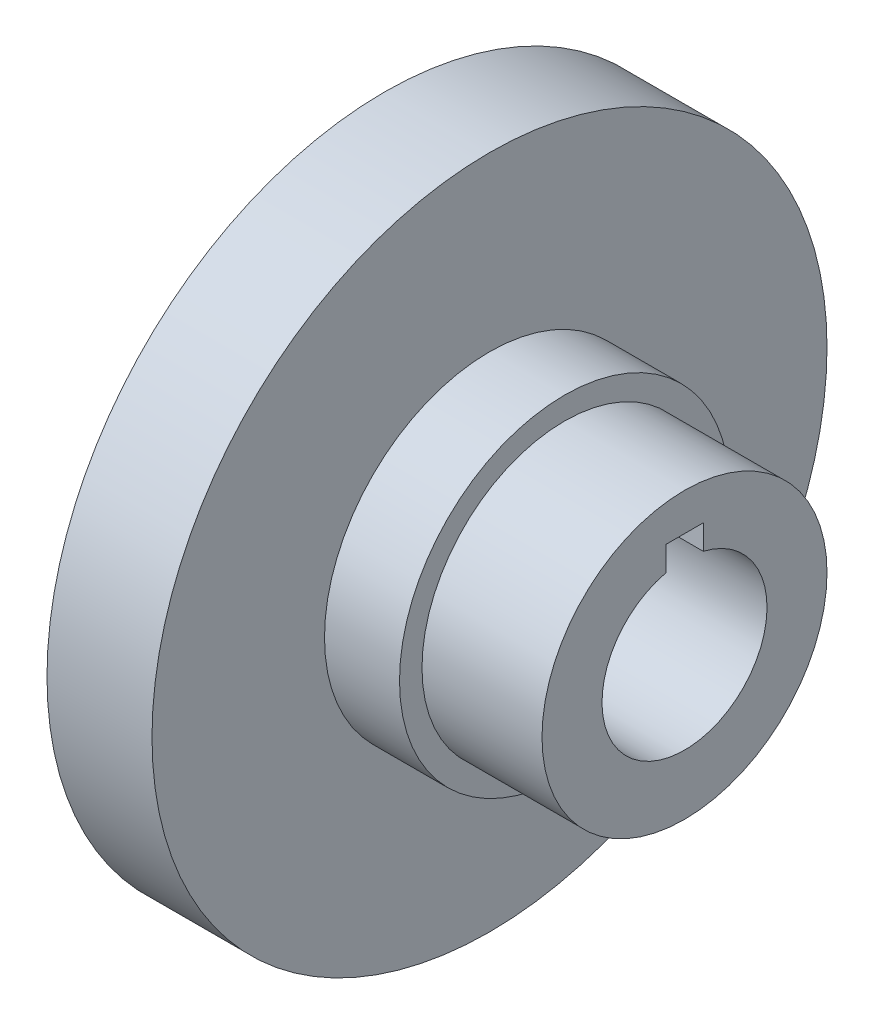
ISO-10303-21;
HEADER;
FILE_DESCRIPTION(('STEP AP214'),'2;1');
FILE_NAME('part.step','',(''),(''),'','','');
FILE_SCHEMA(('AUTOMOTIVE_DESIGN { 1 0 10303 214 1 1 1 1 }'));
ENDSEC;
DATA;
#1=APPLICATION_CONTEXT('core data for automotive mechanical design processes');
#2=APPLICATION_PROTOCOL_DEFINITION('international standard','automotive_design',2000,#1);
#3=PRODUCT_CONTEXT('',#1,'mechanical');
#4=PRODUCT('Part','Part','',(#3));
#5=PRODUCT_RELATED_PRODUCT_CATEGORY('part','',(#4));
#6=PRODUCT_DEFINITION_FORMATION('','',#4);
#7=PRODUCT_DEFINITION_CONTEXT('part definition',#1,'design');
#8=PRODUCT_DEFINITION('design','',#6,#7);
#9=PRODUCT_DEFINITION_SHAPE('','',#8);
#10=(LENGTH_UNIT() NAMED_UNIT(*) SI_UNIT(.MILLI.,.METRE.));
#11=(NAMED_UNIT(*) PLANE_ANGLE_UNIT() SI_UNIT($,.RADIAN.));
#12=(NAMED_UNIT(*) SI_UNIT($,.STERADIAN.) SOLID_ANGLE_UNIT());
#13=UNCERTAINTY_MEASURE_WITH_UNIT(LENGTH_MEASURE(1.E-05),#10,'distance_accuracy_value','');
#14=(GEOMETRIC_REPRESENTATION_CONTEXT(3) GLOBAL_UNCERTAINTY_ASSIGNED_CONTEXT((#13)) GLOBAL_UNIT_ASSIGNED_CONTEXT((#10,
#11,#12)) REPRESENTATION_CONTEXT('',''));
#15=CARTESIAN_POINT('',(0.,0.,0.));
#16=DIRECTION('',(0.,0.,1.));
#17=DIRECTION('',(1.,0.,0.));
#18=AXIS2_PLACEMENT_3D('',#15,#16,#17);
#19=CARTESIAN_POINT('',(24.,0.,0.));
#20=DIRECTION('',(1.,0.,0.));
#21=DIRECTION('',(0.,0.,-1.));
#22=AXIS2_PLACEMENT_3D('',#19,#20,#21);
#23=PLANE('',#22);
#24=CARTESIAN_POINT('',(24.,0.,0.));
#25=DIRECTION('',(1.,0.,0.));
#26=DIRECTION('',(0.,0.,-1.));
#27=AXIS2_PLACEMENT_3D('',#24,#25,#26);
#28=CIRCLE('',#27,22.);
#29=CARTESIAN_POINT('',(24.,0.,-22.));
#30=VERTEX_POINT('',#29);
#31=EDGE_CURVE('E112',#30,#30,#28,.T.);
#32=ORIENTED_EDGE('',*,*,#31,.T.);
#33=EDGE_LOOP('',(#32));
#34=FACE_BOUND('',#33,.T.);
#35=CARTESIAN_POINT('',(24.,0.,0.));
#36=DIRECTION('',(1.,0.,0.));
#37=DIRECTION('',(0.,0.,-1.));
#38=AXIS2_PLACEMENT_3D('',#35,#36,#37);
#39=CIRCLE('',#38,19.);
#40=CARTESIAN_POINT('',(24.,0.,-19.));
#41=VERTEX_POINT('',#40);
#42=EDGE_CURVE('E105',#41,#41,#39,.T.);
#43=ORIENTED_EDGE('',*,*,#42,.F.);
#44=EDGE_LOOP('',(#43));
#45=FACE_BOUND('',#44,.T.);
#46=ADVANCED_FACE('F31',(#34,#45),#23,.T.);
#47=CARTESIAN_POINT('',(14.,0.,0.));
#48=DIRECTION('',(1.,0.,0.));
#49=DIRECTION('',(0.,0.,-1.));
#50=AXIS2_PLACEMENT_3D('',#47,#48,#49);
#51=PLANE('',#50);
#52=CARTESIAN_POINT('',(14.,0.,0.));
#53=DIRECTION('',(1.,0.,0.));
#54=DIRECTION('',(0.,0.,-1.));
#55=AXIS2_PLACEMENT_3D('',#52,#53,#54);
#56=CIRCLE('',#55,45.);
#57=CARTESIAN_POINT('',(14.,0.,-45.));
#58=VERTEX_POINT('',#57);
#59=EDGE_CURVE('E118',#58,#58,#56,.T.);
#60=ORIENTED_EDGE('',*,*,#59,.T.);
#61=EDGE_LOOP('',(#60));
#62=FACE_BOUND('',#61,.T.);
#63=CARTESIAN_POINT('',(14.,0.,0.));
#64=DIRECTION('',(1.,0.,0.));
#65=DIRECTION('',(0.,0.,-1.));
#66=AXIS2_PLACEMENT_3D('',#63,#64,#65);
#67=CIRCLE('',#66,22.);
#68=CARTESIAN_POINT('',(14.,0.,-22.));
#69=VERTEX_POINT('',#68);
#70=EDGE_CURVE('E109',#69,#69,#67,.T.);
#71=ORIENTED_EDGE('',*,*,#70,.F.);
#72=EDGE_LOOP('',(#71));
#73=FACE_BOUND('',#72,.T.);
#74=ADVANCED_FACE('F142',(#62,#73),#51,.T.);
#75=CARTESIAN_POINT('',(14.,0.,0.));
#76=DIRECTION('',(-1.,0.,0.));
#77=DIRECTION('',(0.,0.,1.));
#78=AXIS2_PLACEMENT_3D('',#75,#76,#77);
#79=CYLINDRICAL_SURFACE('',#78,45.);
#80=ORIENTED_EDGE('',*,*,#59,.F.);
#81=EDGE_LOOP('',(#80));
#82=FACE_BOUND('',#81,.T.);
#83=CARTESIAN_POINT('',(0.,0.,0.));
#84=DIRECTION('',(1.,0.,0.));
#85=DIRECTION('',(0.,0.,-1.));
#86=AXIS2_PLACEMENT_3D('',#83,#84,#85);
#87=CIRCLE('',#86,45.);
#88=CARTESIAN_POINT('',(0.,0.,-45.));
#89=VERTEX_POINT('',#88);
#90=EDGE_CURVE('E115',#89,#89,#87,.T.);
#91=ORIENTED_EDGE('',*,*,#90,.T.);
#92=EDGE_LOOP('',(#91));
#93=FACE_BOUND('',#92,.T.);
#94=ADVANCED_FACE('F148',(#82,#93),#79,.T.);
#95=CARTESIAN_POINT('',(0.,0.,0.));
#96=DIRECTION('',(1.,0.,0.));
#97=DIRECTION('',(0.,0.,-1.));
#98=AXIS2_PLACEMENT_3D('',#95,#96,#97);
#99=PLANE('',#98);
#100=CARTESIAN_POINT('',(0.,0.,-34.));
#101=DIRECTION('',(-1.,0.,0.));
#102=DIRECTION('',(0.,0.,1.));
#103=AXIS2_PLACEMENT_3D('',#100,#101,#102);
#104=CIRCLE('',#103,4.);
#105=CARTESIAN_POINT('',(0.,0.,-30.));
#106=VERTEX_POINT('',#105);
#107=EDGE_CURVE('E338',#106,#106,#104,.T.);
#108=ORIENTED_EDGE('',*,*,#107,.F.);
#109=EDGE_LOOP('',(#108));
#110=FACE_BOUND('',#109,.T.);
#111=CARTESIAN_POINT('',(0.,-34.,-3.56131302833157E-13));
#112=DIRECTION('',(-1.,0.,0.));
#113=DIRECTION('',(0.,0.,1.));
#114=AXIS2_PLACEMENT_3D('',#111,#112,#113);
#115=CIRCLE('',#114,4.);
#116=CARTESIAN_POINT('',(0.,-34.,3.99999999999964));
#117=VERTEX_POINT('',#116);
#118=EDGE_CURVE('E340',#117,#117,#115,.T.);
#119=ORIENTED_EDGE('',*,*,#118,.F.);
#120=EDGE_LOOP('',(#119));
#121=FACE_BOUND('',#120,.T.);
#122=CARTESIAN_POINT('',(0.,-2.37420868555438E-13,34.));
#123=DIRECTION('',(-1.,0.,0.));
#124=DIRECTION('',(0.,0.,1.));
#125=AXIS2_PLACEMENT_3D('',#122,#123,#124);
#126=CIRCLE('',#125,4.);
#127=CARTESIAN_POINT('',(0.,-2.37420868555438E-13,38.));
#128=VERTEX_POINT('',#127);
#129=EDGE_CURVE('E346',#128,#128,#126,.T.);
#130=ORIENTED_EDGE('',*,*,#129,.F.);
#131=EDGE_LOOP('',(#130));
#132=FACE_BOUND('',#131,.T.);
#133=CARTESIAN_POINT('',(0.,34.,1.18710434277719E-13));
#134=DIRECTION('',(-1.,0.,0.));
#135=DIRECTION('',(0.,0.,1.));
#136=AXIS2_PLACEMENT_3D('',#133,#134,#135);
#137=CIRCLE('',#136,4.);
#138=CARTESIAN_POINT('',(0.,34.,4.00000000000012));
#139=VERTEX_POINT('',#138);
#140=EDGE_CURVE('E352',#139,#139,#137,.T.);
#141=ORIENTED_EDGE('',*,*,#140,.F.);
#142=EDGE_LOOP('',(#141));
#143=FACE_BOUND('',#142,.T.);
#144=CARTESIAN_POINT('',(0.,0.,0.));
#145=DIRECTION('',(-1.,0.,0.));
#146=DIRECTION('',(0.,0.,1.));
#147=AXIS2_PLACEMENT_3D('',#144,#145,#146);
#148=CIRCLE('',#147,23.);
#149=CARTESIAN_POINT('',(0.,0.,23.));
#150=VERTEX_POINT('',#149);
#151=EDGE_CURVE('E100',#150,#150,#148,.T.);
#152=ORIENTED_EDGE('',*,*,#151,.F.);
#153=EDGE_LOOP('',(#152));
#154=FACE_BOUND('',#153,.T.);
#155=ORIENTED_EDGE('',*,*,#90,.F.);
#156=EDGE_LOOP('',(#155));
#157=FACE_BOUND('',#156,.T.);
#158=ADVANCED_FACE('F158',(#110,#121,#132,#143,#154,#157),#99,.F.);
#159=CARTESIAN_POINT('',(24.,0.,0.));
#160=DIRECTION('',(-1.,0.,0.));
#161=DIRECTION('',(0.,0.,1.));
#162=AXIS2_PLACEMENT_3D('',#159,#160,#161);
#163=CYLINDRICAL_SURFACE('',#162,22.);
#164=ORIENTED_EDGE('',*,*,#31,.F.);
#165=EDGE_LOOP('',(#164));
#166=FACE_BOUND('',#165,.T.);
#167=ORIENTED_EDGE('',*,*,#70,.T.);
#168=EDGE_LOOP('',(#167));
#169=FACE_BOUND('',#168,.T.);
#170=ADVANCED_FACE('F156',(#166,#169),#163,.T.);
#171=CARTESIAN_POINT('',(40.,0.,0.));
#172=DIRECTION('',(-1.,0.,0.));
#173=DIRECTION('',(0.,0.,1.));
#174=AXIS2_PLACEMENT_3D('',#171,#172,#173);
#175=CYLINDRICAL_SURFACE('',#174,19.);
#176=CARTESIAN_POINT('',(40.,0.,0.));
#177=DIRECTION('',(1.,0.,0.));
#178=DIRECTION('',(0.,0.,-1.));
#179=AXIS2_PLACEMENT_3D('',#176,#177,#178);
#180=CIRCLE('',#179,19.);
#181=CARTESIAN_POINT('',(40.,0.,-19.));
#182=VERTEX_POINT('',#181);
#183=EDGE_CURVE('E106',#182,#182,#180,.T.);
#184=ORIENTED_EDGE('',*,*,#183,.F.);
#185=EDGE_LOOP('',(#184));
#186=FACE_BOUND('',#185,.T.);
#187=ORIENTED_EDGE('',*,*,#42,.T.);
#188=EDGE_LOOP('',(#187));
#189=FACE_BOUND('',#188,.T.);
#190=ADVANCED_FACE('F154',(#186,#189),#175,.T.);
#191=CARTESIAN_POINT('',(40.,0.,0.));
#192=DIRECTION('',(1.,0.,0.));
#193=DIRECTION('',(0.,0.,-1.));
#194=AXIS2_PLACEMENT_3D('',#191,#192,#193);
#195=PLANE('',#194);
#196=DIRECTION('',(0.,1.,0.));
#197=VECTOR('',#196,1.);
#198=CARTESIAN_POINT('',(40.,14.,-2.5));
#199=LINE('',#198,#197);
#200=CARTESIAN_POINT('',(40.,10.7121426428143,-2.5));
#201=VERTEX_POINT('',#200);
#202=CARTESIAN_POINT('',(40.,14.,-2.5));
#203=VERTEX_POINT('',#202);
#204=EDGE_CURVE('E72',#201,#203,#199,.T.);
#205=ORIENTED_EDGE('',*,*,#204,.F.);
#206=CARTESIAN_POINT('',(40.,0.,0.));
#207=DIRECTION('',(-1.,0.,0.));
#208=DIRECTION('',(0.,0.,1.));
#209=AXIS2_PLACEMENT_3D('',#206,#207,#208);
#210=CIRCLE('',#209,11.);
#211=CARTESIAN_POINT('',(40.,10.7121426428143,2.5));
#212=VERTEX_POINT('',#211);
#213=EDGE_CURVE('E98',#201,#212,#210,.T.);
#214=ORIENTED_EDGE('',*,*,#213,.T.);
#215=DIRECTION('',(0.,1.,0.));
#216=VECTOR('',#215,1.);
#217=CARTESIAN_POINT('',(40.,14.,2.5));
#218=LINE('',#217,#216);
#219=CARTESIAN_POINT('',(40.,14.,2.5));
#220=VERTEX_POINT('',#219);
#221=EDGE_CURVE('E46',#212,#220,#218,.T.);
#222=ORIENTED_EDGE('',*,*,#221,.T.);
#223=DIRECTION('',(0.,0.,1.));
#224=VECTOR('',#223,1.);
#225=CARTESIAN_POINT('',(40.,14.,-2.5));
#226=LINE('',#225,#224);
#227=EDGE_CURVE('E86',#203,#220,#226,.T.);
#228=ORIENTED_EDGE('',*,*,#227,.F.);
#229=EDGE_LOOP('',(#205,#214,#222,#228));
#230=FACE_BOUND('',#229,.T.);
#231=ORIENTED_EDGE('',*,*,#183,.T.);
#232=EDGE_LOOP('',(#231));
#233=FACE_BOUND('',#232,.T.);
#234=ADVANCED_FACE('F90',(#230,#233),#195,.T.);
#235=CARTESIAN_POINT('',(12.,0.,0.));
#236=DIRECTION('',(-1.,0.,0.));
#237=DIRECTION('',(0.,0.,1.));
#238=AXIS2_PLACEMENT_3D('',#235,#236,#237);
#239=CYLINDRICAL_SURFACE('',#238,23.);
#240=CARTESIAN_POINT('',(9.,0.,0.));
#241=DIRECTION('',(-1.,0.,0.));
#242=DIRECTION('',(0.,0.,1.));
#243=AXIS2_PLACEMENT_3D('',#240,#241,#242);
#244=CIRCLE('',#243,23.);
#245=CARTESIAN_POINT('',(9.,0.,23.));
#246=VERTEX_POINT('',#245);
#247=EDGE_CURVE('E11',#246,#246,#244,.F.);
#248=ORIENTED_EDGE('',*,*,#247,.T.);
#249=EDGE_LOOP('',(#248));
#250=FACE_BOUND('',#249,.T.);
#251=ORIENTED_EDGE('',*,*,#151,.T.);
#252=EDGE_LOOP('',(#251));
#253=FACE_BOUND('',#252,.T.);
#254=ADVANCED_FACE('F198',(#250,#253),#239,.F.);
#255=CARTESIAN_POINT('',(12.,0.,0.));
#256=DIRECTION('',(-1.,0.,0.));
#257=DIRECTION('',(0.,0.,1.));
#258=AXIS2_PLACEMENT_3D('',#255,#256,#257);
#259=PLANE('',#258);
#260=CARTESIAN_POINT('',(12.,0.,0.));
#261=DIRECTION('',(-1.,0.,0.));
#262=DIRECTION('',(0.,0.,1.));
#263=AXIS2_PLACEMENT_3D('',#260,#261,#262);
#264=CIRCLE('',#263,20.);
#265=CARTESIAN_POINT('',(12.,0.,20.));
#266=VERTEX_POINT('',#265);
#267=EDGE_CURVE('E39',#266,#266,#264,.T.);
#268=ORIENTED_EDGE('',*,*,#267,.T.);
#269=EDGE_LOOP('',(#268));
#270=FACE_BOUND('',#269,.T.);
#271=DIRECTION('',(0.,-1.,0.));
#272=VECTOR('',#271,1.);
#273=CARTESIAN_POINT('',(12.,0.,-2.5));
#274=LINE('',#273,#272);
#275=CARTESIAN_POINT('',(12.,14.,-2.5));
#276=VERTEX_POINT('',#275);
#277=CARTESIAN_POINT('',(12.,10.7121426428143,-2.5));
#278=VERTEX_POINT('',#277);
#279=EDGE_CURVE('E54',#276,#278,#274,.T.);
#280=ORIENTED_EDGE('',*,*,#279,.F.);
#281=DIRECTION('',(0.,0.,1.));
#282=VECTOR('',#281,1.);
#283=CARTESIAN_POINT('',(12.,14.,-2.5));
#284=LINE('',#283,#282);
#285=CARTESIAN_POINT('',(12.,14.,2.5));
#286=VERTEX_POINT('',#285);
#287=EDGE_CURVE('E88',#276,#286,#284,.T.);
#288=ORIENTED_EDGE('',*,*,#287,.T.);
#289=DIRECTION('',(0.,-1.,0.));
#290=VECTOR('',#289,1.);
#291=CARTESIAN_POINT('',(12.,0.,2.5));
#292=LINE('',#291,#290);
#293=CARTESIAN_POINT('',(12.,10.7121426428143,2.5));
#294=VERTEX_POINT('',#293);
#295=EDGE_CURVE('E81',#286,#294,#292,.T.);
#296=ORIENTED_EDGE('',*,*,#295,.T.);
#297=CARTESIAN_POINT('',(12.,0.,0.));
#298=DIRECTION('',(-1.,0.,0.));
#299=DIRECTION('',(0.,0.,1.));
#300=AXIS2_PLACEMENT_3D('',#297,#298,#299);
#301=CIRCLE('',#300,11.);
#302=EDGE_CURVE('E93',#278,#294,#301,.T.);
#303=ORIENTED_EDGE('',*,*,#302,.F.);
#304=EDGE_LOOP('',(#280,#288,#296,#303));
#305=FACE_BOUND('',#304,.T.);
#306=ADVANCED_FACE('F128',(#270,#305),#259,.T.);
#307=CARTESIAN_POINT('',(40.,0.,0.));
#308=DIRECTION('',(-1.,0.,0.));
#309=DIRECTION('',(0.,0.,1.));
#310=AXIS2_PLACEMENT_3D('',#307,#308,#309);
#311=CYLINDRICAL_SURFACE('',#310,11.);
#312=ORIENTED_EDGE('',*,*,#213,.F.);
#313=DIRECTION('',(-1.,0.,0.));
#314=VECTOR('',#313,1.);
#315=CARTESIAN_POINT('',(40.,10.7121426428143,-2.5));
#316=LINE('',#315,#314);
#317=EDGE_CURVE('E76',#201,#278,#316,.T.);
#318=ORIENTED_EDGE('',*,*,#317,.T.);
#319=ORIENTED_EDGE('',*,*,#302,.T.);
#320=DIRECTION('',(-1.,0.,0.));
#321=VECTOR('',#320,1.);
#322=CARTESIAN_POINT('',(40.,10.7121426428143,2.5));
#323=LINE('',#322,#321);
#324=EDGE_CURVE('E121',#212,#294,#323,.T.);
#325=ORIENTED_EDGE('',*,*,#324,.F.);
#326=EDGE_LOOP('',(#312,#318,#319,#325));
#327=FACE_BOUND('',#326,.T.);
#328=ADVANCED_FACE('F216',(#327),#311,.F.);
#329=CARTESIAN_POINT('',(40.,0.,-2.5));
#330=DIRECTION('',(0.,0.,-1.));
#331=DIRECTION('',(-1.,0.,0.));
#332=AXIS2_PLACEMENT_3D('',#329,#330,#331);
#333=PLANE('',#332);
#334=ORIENTED_EDGE('',*,*,#204,.T.);
#335=DIRECTION('',(-1.,0.,0.));
#336=VECTOR('',#335,1.);
#337=CARTESIAN_POINT('',(12.,14.,-2.5));
#338=LINE('',#337,#336);
#339=EDGE_CURVE('E75',#203,#276,#338,.T.);
#340=ORIENTED_EDGE('',*,*,#339,.T.);
#341=ORIENTED_EDGE('',*,*,#279,.T.);
#342=ORIENTED_EDGE('',*,*,#317,.F.);
#343=EDGE_LOOP('',(#334,#340,#341,#342));
#344=FACE_BOUND('',#343,.T.);
#345=ADVANCED_FACE('F74',(#344),#333,.F.);
#346=CARTESIAN_POINT('',(40.,0.,2.5));
#347=DIRECTION('',(0.,0.,-1.));
#348=DIRECTION('',(-1.,0.,0.));
#349=AXIS2_PLACEMENT_3D('',#346,#347,#348);
#350=PLANE('',#349);
#351=ORIENTED_EDGE('',*,*,#324,.T.);
#352=ORIENTED_EDGE('',*,*,#295,.F.);
#353=DIRECTION('',(-1.,0.,0.));
#354=VECTOR('',#353,1.);
#355=CARTESIAN_POINT('',(12.,14.,2.5));
#356=LINE('',#355,#354);
#357=EDGE_CURVE('E361',#220,#286,#356,.T.);
#358=ORIENTED_EDGE('',*,*,#357,.F.);
#359=ORIENTED_EDGE('',*,*,#221,.F.);
#360=EDGE_LOOP('',(#351,#352,#358,#359));
#361=FACE_BOUND('',#360,.T.);
#362=ADVANCED_FACE('F230',(#361),#350,.T.);
#363=CARTESIAN_POINT('',(12.,14.,-2.5));
#364=DIRECTION('',(0.,1.,0.));
#365=DIRECTION('',(0.,0.,1.));
#366=AXIS2_PLACEMENT_3D('',#363,#364,#365);
#367=PLANE('',#366);
#368=ORIENTED_EDGE('',*,*,#357,.T.);
#369=ORIENTED_EDGE('',*,*,#287,.F.);
#370=ORIENTED_EDGE('',*,*,#339,.F.);
#371=ORIENTED_EDGE('',*,*,#227,.T.);
#372=EDGE_LOOP('',(#368,#369,#370,#371));
#373=FACE_BOUND('',#372,.T.);
#374=ADVANCED_FACE('F85',(#373),#367,.F.);
#375=CARTESIAN_POINT('',(12.,34.,1.18710434277719E-13));
#376=DIRECTION('',(-1.,0.,0.));
#377=DIRECTION('',(0.,0.,1.));
#378=AXIS2_PLACEMENT_3D('',#375,#376,#377);
#379=CYLINDRICAL_SURFACE('',#378,4.);
#380=CARTESIAN_POINT('',(12.,34.,1.18710434277719E-13));
#381=DIRECTION('',(-1.,0.,0.));
#382=DIRECTION('',(0.,0.,1.));
#383=AXIS2_PLACEMENT_3D('',#380,#381,#382);
#384=CIRCLE('',#383,4.);
#385=CARTESIAN_POINT('',(12.,34.,4.00000000000012));
#386=VERTEX_POINT('',#385);
#387=EDGE_CURVE('E355',#386,#386,#384,.T.);
#388=ORIENTED_EDGE('',*,*,#387,.F.);
#389=EDGE_LOOP('',(#388));
#390=FACE_BOUND('',#389,.T.);
#391=ORIENTED_EDGE('',*,*,#140,.T.);
#392=EDGE_LOOP('',(#391));
#393=FACE_BOUND('',#392,.T.);
#394=ADVANCED_FACE('F242',(#390,#393),#379,.F.);
#395=CARTESIAN_POINT('',(12.,-99.1414213562373,0.));
#396=DIRECTION('',(-1.,0.,0.));
#397=DIRECTION('',(0.,0.,1.));
#398=AXIS2_PLACEMENT_3D('',#395,#396,#397);
#399=PLANE('',#398);
#400=ORIENTED_EDGE('',*,*,#387,.T.);
#401=EDGE_LOOP('',(#400));
#402=FACE_BOUND('',#401,.T.);
#403=ADVANCED_FACE('F248',(#402),#399,.T.);
#404=CARTESIAN_POINT('',(12.,-2.37420868555438E-13,34.));
#405=DIRECTION('',(-1.,0.,0.));
#406=DIRECTION('',(0.,0.,1.));
#407=AXIS2_PLACEMENT_3D('',#404,#405,#406);
#408=CYLINDRICAL_SURFACE('',#407,4.);
#409=CARTESIAN_POINT('',(12.,-2.37420868555438E-13,34.));
#410=DIRECTION('',(-1.,0.,0.));
#411=DIRECTION('',(0.,0.,1.));
#412=AXIS2_PLACEMENT_3D('',#409,#410,#411);
#413=CIRCLE('',#412,4.);
#414=CARTESIAN_POINT('',(12.,-2.37420868555438E-13,38.));
#415=VERTEX_POINT('',#414);
#416=EDGE_CURVE('E349',#415,#415,#413,.T.);
#417=ORIENTED_EDGE('',*,*,#416,.F.);
#418=EDGE_LOOP('',(#417));
#419=FACE_BOUND('',#418,.T.);
#420=ORIENTED_EDGE('',*,*,#129,.T.);
#421=EDGE_LOOP('',(#420));
#422=FACE_BOUND('',#421,.T.);
#423=ADVANCED_FACE('F256',(#419,#422),#408,.F.);
#424=CARTESIAN_POINT('',(12.,-99.1414213562373,0.));
#425=DIRECTION('',(-1.,0.,0.));
#426=DIRECTION('',(0.,0.,1.));
#427=AXIS2_PLACEMENT_3D('',#424,#425,#426);
#428=PLANE('',#427);
#429=ORIENTED_EDGE('',*,*,#416,.T.);
#430=EDGE_LOOP('',(#429));
#431=FACE_BOUND('',#430,.T.);
#432=ADVANCED_FACE('F264',(#431),#428,.T.);
#433=CARTESIAN_POINT('',(12.,-34.,-3.56131302833157E-13));
#434=DIRECTION('',(-1.,0.,0.));
#435=DIRECTION('',(0.,0.,1.));
#436=AXIS2_PLACEMENT_3D('',#433,#434,#435);
#437=CYLINDRICAL_SURFACE('',#436,4.);
#438=CARTESIAN_POINT('',(12.,-34.,-3.56131302833157E-13));
#439=DIRECTION('',(-1.,0.,0.));
#440=DIRECTION('',(0.,0.,1.));
#441=AXIS2_PLACEMENT_3D('',#438,#439,#440);
#442=CIRCLE('',#441,4.);
#443=CARTESIAN_POINT('',(12.,-34.,3.99999999999964));
#444=VERTEX_POINT('',#443);
#445=EDGE_CURVE('E343',#444,#444,#442,.T.);
#446=ORIENTED_EDGE('',*,*,#445,.F.);
#447=EDGE_LOOP('',(#446));
#448=FACE_BOUND('',#447,.T.);
#449=ORIENTED_EDGE('',*,*,#118,.T.);
#450=EDGE_LOOP('',(#449));
#451=FACE_BOUND('',#450,.T.);
#452=ADVANCED_FACE('F272',(#448,#451),#437,.F.);
#453=CARTESIAN_POINT('',(12.,-99.1414213562373,0.));
#454=DIRECTION('',(-1.,0.,0.));
#455=DIRECTION('',(0.,0.,1.));
#456=AXIS2_PLACEMENT_3D('',#453,#454,#455);
#457=PLANE('',#456);
#458=ORIENTED_EDGE('',*,*,#445,.T.);
#459=EDGE_LOOP('',(#458));
#460=FACE_BOUND('',#459,.T.);
#461=ADVANCED_FACE('F280',(#460),#457,.T.);
#462=CARTESIAN_POINT('',(12.,0.,-34.));
#463=DIRECTION('',(-1.,0.,0.));
#464=DIRECTION('',(0.,0.,1.));
#465=AXIS2_PLACEMENT_3D('',#462,#463,#464);
#466=CYLINDRICAL_SURFACE('',#465,4.);
#467=CARTESIAN_POINT('',(12.,0.,-34.));
#468=DIRECTION('',(-1.,0.,0.));
#469=DIRECTION('',(0.,0.,1.));
#470=AXIS2_PLACEMENT_3D('',#467,#468,#469);
#471=CIRCLE('',#470,4.);
#472=CARTESIAN_POINT('',(12.,0.,-30.));
#473=VERTEX_POINT('',#472);
#474=EDGE_CURVE('E335',#473,#473,#471,.T.);
#475=ORIENTED_EDGE('',*,*,#474,.F.);
#476=EDGE_LOOP('',(#475));
#477=FACE_BOUND('',#476,.T.);
#478=ORIENTED_EDGE('',*,*,#107,.T.);
#479=EDGE_LOOP('',(#478));
#480=FACE_BOUND('',#479,.T.);
#481=ADVANCED_FACE('F137',(#477,#480),#466,.F.);
#482=CARTESIAN_POINT('',(12.,-99.1414213562373,0.));
#483=DIRECTION('',(-1.,0.,0.));
#484=DIRECTION('',(0.,0.,1.));
#485=AXIS2_PLACEMENT_3D('',#482,#483,#484);
#486=PLANE('',#485);
#487=ORIENTED_EDGE('',*,*,#474,.T.);
#488=EDGE_LOOP('',(#487));
#489=FACE_BOUND('',#488,.T.);
#490=ADVANCED_FACE('F132',(#489),#486,.T.);
#491=CARTESIAN_POINT('',(9.,0.,0.));
#492=DIRECTION('',(-1.,0.,0.));
#493=DIRECTION('',(0.,0.,1.));
#494=AXIS2_PLACEMENT_3D('',#491,#492,#493);
#495=TOROIDAL_SURFACE('',#494,20.,3.);
#496=ORIENTED_EDGE('',*,*,#247,.F.);
#497=EDGE_LOOP('',(#496));
#498=FACE_BOUND('',#497,.T.);
#499=ORIENTED_EDGE('',*,*,#267,.F.);
#500=EDGE_LOOP('',(#499));
#501=FACE_BOUND('',#500,.T.);
#502=ADVANCED_FACE('F33',(#498,#501),#495,.F.);
#503=CLOSED_SHELL('',(#46,#74,#94,#158,#170,#190,#234,#254,#306,#328,#345,#362,#374,#394,#403,
#423,#432,#452,#461,#481,#490,#502));
#504=MANIFOLD_SOLID_BREP('B2',#503);
#505=ADVANCED_BREP_SHAPE_REPRESENTATION('',(#18,#504),#14);
#506=SHAPE_DEFINITION_REPRESENTATION(#9,#505);
ENDSEC;
END-ISO-10303-21;
